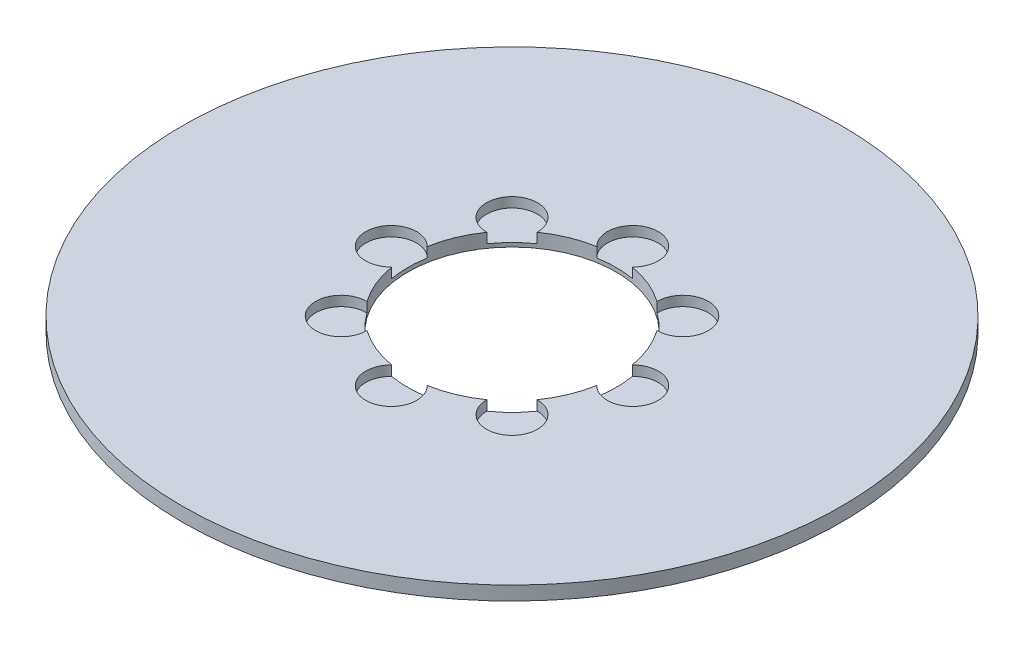
ISO-10303-21;
HEADER;
FILE_DESCRIPTION(('STEP AP214'),'2;1');
FILE_NAME('part.step','',(''),(''),'','','');
FILE_SCHEMA(('AUTOMOTIVE_DESIGN { 1 0 10303 214 1 1 1 1 }'));
ENDSEC;
DATA;
#1=APPLICATION_CONTEXT('core data for automotive mechanical design processes');
#2=APPLICATION_PROTOCOL_DEFINITION('international standard','automotive_design',2000,#1);
#3=PRODUCT_CONTEXT('',#1,'mechanical');
#4=PRODUCT('Part','Part','',(#3));
#5=PRODUCT_RELATED_PRODUCT_CATEGORY('part','',(#4));
#6=PRODUCT_DEFINITION_FORMATION('','',#4);
#7=PRODUCT_DEFINITION_CONTEXT('part definition',#1,'design');
#8=PRODUCT_DEFINITION('design','',#6,#7);
#9=PRODUCT_DEFINITION_SHAPE('','',#8);
#10=(LENGTH_UNIT() NAMED_UNIT(*) SI_UNIT(.MILLI.,.METRE.));
#11=(NAMED_UNIT(*) PLANE_ANGLE_UNIT() SI_UNIT($,.RADIAN.));
#12=(NAMED_UNIT(*) SI_UNIT($,.STERADIAN.) SOLID_ANGLE_UNIT());
#13=UNCERTAINTY_MEASURE_WITH_UNIT(LENGTH_MEASURE(1.E-05),#10,'distance_accuracy_value','');
#14=(GEOMETRIC_REPRESENTATION_CONTEXT(3) GLOBAL_UNCERTAINTY_ASSIGNED_CONTEXT((#13)) GLOBAL_UNIT_ASSIGNED_CONTEXT((#10,
#11,#12)) REPRESENTATION_CONTEXT('',''));
#15=CARTESIAN_POINT('',(0.,0.,0.));
#16=DIRECTION('',(0.,0.,1.));
#17=DIRECTION('',(1.,0.,0.));
#18=AXIS2_PLACEMENT_3D('',#15,#16,#17);
#19=CARTESIAN_POINT('',(0.,4.,0.));
#20=DIRECTION('',(0.,-1.,0.));
#21=DIRECTION('',(0.,0.,-1.));
#22=AXIS2_PLACEMENT_3D('',#19,#20,#21);
#23=CYLINDRICAL_SURFACE('',#22,95.);
#24=CARTESIAN_POINT('',(0.,4.,0.));
#25=DIRECTION('',(0.,1.,0.));
#26=DIRECTION('',(0.,0.,1.));
#27=AXIS2_PLACEMENT_3D('',#24,#25,#26);
#28=CIRCLE('',#27,95.);
#29=CARTESIAN_POINT('',(0.,4.,95.));
#30=VERTEX_POINT('',#29);
#31=EDGE_CURVE('E195',#30,#30,#28,.T.);
#32=ORIENTED_EDGE('',*,*,#31,.F.);
#33=EDGE_LOOP('',(#32));
#34=FACE_BOUND('',#33,.T.);
#35=CARTESIAN_POINT('',(0.,0.,0.));
#36=DIRECTION('',(0.,1.,0.));
#37=DIRECTION('',(0.,0.,1.));
#38=AXIS2_PLACEMENT_3D('',#35,#36,#37);
#39=CIRCLE('',#38,95.);
#40=CARTESIAN_POINT('',(0.,0.,95.));
#41=VERTEX_POINT('',#40);
#42=EDGE_CURVE('E179',#41,#41,#39,.T.);
#43=ORIENTED_EDGE('',*,*,#42,.T.);
#44=EDGE_LOOP('',(#43));
#45=FACE_BOUND('',#44,.T.);
#46=ADVANCED_FACE('F39',(#34,#45),#23,.T.);
#47=CARTESIAN_POINT('',(0.,4.,0.));
#48=DIRECTION('',(0.,1.,0.));
#49=DIRECTION('',(0.,0.,1.));
#50=AXIS2_PLACEMENT_3D('',#47,#48,#49);
#51=PLANE('',#50);
#52=CARTESIAN_POINT('',(1.21564885016385E-13,4.,34.8175668774056));
#53=DIRECTION('',(0.,1.,0.));
#54=DIRECTION('',(1.,0.,0.));
#55=AXIS2_PLACEMENT_3D('',#52,#53,#54);
#56=CIRCLE('',#55,7.33550777129493);
#57=CARTESIAN_POINT('',(-5.11600563197545,4.,29.5605562595428));
#58=VERTEX_POINT('',#57);
#59=CARTESIAN_POINT('',(5.11600563197565,4.,29.5605562595428));
#60=VERTEX_POINT('',#59);
#61=EDGE_CURVE('E176',#58,#60,#56,.T.);
#62=ORIENTED_EDGE('',*,*,#61,.F.);
#63=CARTESIAN_POINT('',(0.,4.,0.));
#64=DIRECTION('',(0.,1.,0.));
#65=DIRECTION('',(0.,0.,1.));
#66=AXIS2_PLACEMENT_3D('',#63,#64,#65);
#67=CIRCLE('',#66,30.);
#68=CARTESIAN_POINT('',(-17.2849075118106,4.,24.5200320617277));
#69=VERTEX_POINT('',#68);
#70=EDGE_CURVE('E166',#69,#58,#67,.T.);
#71=ORIENTED_EDGE('',*,*,#70,.F.);
#72=CARTESIAN_POINT('',(-24.6197376434296,4.,24.6197376434297));
#73=DIRECTION('',(0.,1.,0.));
#74=DIRECTION('',(0.707106781186549,0.,0.707106781186546));
#75=AXIS2_PLACEMENT_3D('',#72,#73,#74);
#76=CIRCLE('',#75,7.33550777129493);
#77=CARTESIAN_POINT('',(-24.5200320617276,4.,17.2849075118107));
#78=VERTEX_POINT('',#77);
#79=EDGE_CURVE('E147',#78,#69,#76,.T.);
#80=ORIENTED_EDGE('',*,*,#79,.F.);
#81=CARTESIAN_POINT('',(-29.5605562595428,4.,5.11600563197555));
#82=VERTEX_POINT('',#81);
#83=EDGE_CURVE('E180',#82,#78,#67,.T.);
#84=ORIENTED_EDGE('',*,*,#83,.F.);
#85=CARTESIAN_POINT('',(-34.8175668774056,4.,0.));
#86=DIRECTION('',(0.,1.,0.));
#87=DIRECTION('',(0.,0.,1.));
#88=AXIS2_PLACEMENT_3D('',#85,#86,#87);
#89=CIRCLE('',#88,7.33550777129493);
#90=CARTESIAN_POINT('',(-29.5605562595428,4.,-5.11600563197555));
#91=VERTEX_POINT('',#90);
#92=EDGE_CURVE('E186',#91,#82,#89,.T.);
#93=ORIENTED_EDGE('',*,*,#92,.F.);
#94=CARTESIAN_POINT('',(-24.5200320617278,4.,-17.2849075118104));
#95=VERTEX_POINT('',#94);
#96=EDGE_CURVE('E182',#95,#91,#67,.T.);
#97=ORIENTED_EDGE('',*,*,#96,.F.);
#98=CARTESIAN_POINT('',(-24.61973764343,4.,-24.6197376434294));
#99=DIRECTION('',(0.,1.,0.));
#100=DIRECTION('',(-0.707106781186539,0.,0.707106781186556));
#101=AXIS2_PLACEMENT_3D('',#98,#99,#100);
#102=CIRCLE('',#101,7.33550777129493);
#103=CARTESIAN_POINT('',(-17.284907511811,4.,-24.5200320617274));
#104=VERTEX_POINT('',#103);
#105=EDGE_CURVE('E446',#104,#95,#102,.T.);
#106=ORIENTED_EDGE('',*,*,#105,.F.);
#107=CARTESIAN_POINT('',(-5.11600563197586,4.,-29.5605562595427));
#108=VERTEX_POINT('',#107);
#109=EDGE_CURVE('E452',#108,#104,#67,.T.);
#110=ORIENTED_EDGE('',*,*,#109,.F.);
#111=CARTESIAN_POINT('',(-3.64694655049154E-13,4.,-34.8175668774056));
#112=DIRECTION('',(0.,1.,0.));
#113=DIRECTION('',(-1.,0.,0.));
#114=AXIS2_PLACEMENT_3D('',#111,#112,#113);
#115=CIRCLE('',#114,7.33550777129493);
#116=CARTESIAN_POINT('',(5.11600563197524,4.,-29.5605562595428));
#117=VERTEX_POINT('',#116);
#118=EDGE_CURVE('E477',#117,#108,#115,.T.);
#119=ORIENTED_EDGE('',*,*,#118,.F.);
#120=CARTESIAN_POINT('',(17.2849075118105,4.,-24.5200320617278));
#121=VERTEX_POINT('',#120);
#122=EDGE_CURVE('E460',#121,#117,#67,.T.);
#123=ORIENTED_EDGE('',*,*,#122,.F.);
#124=CARTESIAN_POINT('',(24.6197376434294,4.,-24.6197376434299));
#125=DIRECTION('',(0.,1.,0.));
#126=DIRECTION('',(-0.707106781186554,0.,-0.707106781186541));
#127=AXIS2_PLACEMENT_3D('',#124,#125,#126);
#128=CIRCLE('',#127,7.33550777129493);
#129=CARTESIAN_POINT('',(24.5200320617275,4.,-17.2849075118109));
#130=VERTEX_POINT('',#129);
#131=EDGE_CURVE('E464',#130,#121,#128,.T.);
#132=ORIENTED_EDGE('',*,*,#131,.F.);
#133=CARTESIAN_POINT('',(29.5605562595428,4.,-5.11600563197555));
#134=VERTEX_POINT('',#133);
#135=EDGE_CURVE('E459',#134,#130,#67,.T.);
#136=ORIENTED_EDGE('',*,*,#135,.F.);
#137=CARTESIAN_POINT('',(34.8175668774056,4.,0.));
#138=DIRECTION('',(0.,1.,0.));
#139=DIRECTION('',(0.,0.,-1.));
#140=AXIS2_PLACEMENT_3D('',#137,#138,#139);
#141=CIRCLE('',#140,7.33550777129493);
#142=CARTESIAN_POINT('',(29.5605562595428,4.,5.11600563197555));
#143=VERTEX_POINT('',#142);
#144=EDGE_CURVE('E469',#143,#134,#141,.T.);
#145=ORIENTED_EDGE('',*,*,#144,.F.);
#146=CARTESIAN_POINT('',(24.5200320617277,4.,17.2849075118105));
#147=VERTEX_POINT('',#146);
#148=EDGE_CURVE('E181',#147,#143,#67,.T.);
#149=ORIENTED_EDGE('',*,*,#148,.F.);
#150=CARTESIAN_POINT('',(24.6197376434298,4.,24.6197376434295));
#151=DIRECTION('',(0.,1.,0.));
#152=DIRECTION('',(0.707106781186544,0.,-0.707106781186551));
#153=AXIS2_PLACEMENT_3D('',#150,#151,#152);
#154=CIRCLE('',#153,7.33550777129493);
#155=CARTESIAN_POINT('',(17.2849075118108,4.,24.5200320617275));
#156=VERTEX_POINT('',#155);
#157=EDGE_CURVE('E475',#156,#147,#154,.T.);
#158=ORIENTED_EDGE('',*,*,#157,.F.);
#159=EDGE_CURVE('E177',#60,#156,#67,.T.);
#160=ORIENTED_EDGE('',*,*,#159,.F.);
#161=EDGE_LOOP('',(#62,#71,#80,#84,#93,#97,#106,#110,#119,#123,#132,#136,#145,#149,#158,#160));
#162=FACE_BOUND('',#161,.T.);
#163=ORIENTED_EDGE('',*,*,#31,.T.);
#164=EDGE_LOOP('',(#163));
#165=FACE_BOUND('',#164,.T.);
#166=ADVANCED_FACE('F172',(#162,#165),#51,.T.);
#167=CARTESIAN_POINT('',(0.,0.,0.));
#168=DIRECTION('',(0.,1.,0.));
#169=DIRECTION('',(0.,0.,1.));
#170=AXIS2_PLACEMENT_3D('',#167,#168,#169);
#171=PLANE('',#170);
#172=CARTESIAN_POINT('',(0.,0.,0.));
#173=DIRECTION('',(0.,1.,0.));
#174=DIRECTION('',(0.,0.,1.));
#175=AXIS2_PLACEMENT_3D('',#172,#173,#174);
#176=CIRCLE('',#175,30.);
#177=CARTESIAN_POINT('',(0.,0.,30.));
#178=VERTEX_POINT('',#177);
#179=EDGE_CURVE('E187',#178,#178,#176,.T.);
#180=ORIENTED_EDGE('',*,*,#179,.T.);
#181=EDGE_LOOP('',(#180));
#182=FACE_BOUND('',#181,.T.);
#183=ORIENTED_EDGE('',*,*,#42,.F.);
#184=EDGE_LOOP('',(#183));
#185=FACE_BOUND('',#184,.T.);
#186=ADVANCED_FACE('F270',(#182,#185),#171,.F.);
#187=CARTESIAN_POINT('',(0.,4.,0.));
#188=DIRECTION('',(0.,-1.,0.));
#189=DIRECTION('',(0.,0.,-1.));
#190=AXIS2_PLACEMENT_3D('',#187,#188,#189);
#191=CYLINDRICAL_SURFACE('',#190,30.);
#192=DIRECTION('',(0.,1.,0.));
#193=VECTOR('',#192,1.);
#194=CARTESIAN_POINT('',(-5.11600563197544,2.56951452846991,29.5605562595428));
#195=LINE('',#194,#193);
#196=CARTESIAN_POINT('',(-5.11600563197545,1.13902905693982,29.5605562595428));
#197=VERTEX_POINT('',#196);
#198=EDGE_CURVE('E11',#197,#58,#195,.T.);
#199=ORIENTED_EDGE('',*,*,#198,.F.);
#200=CARTESIAN_POINT('',(0.,1.13902905693982,0.));
#201=DIRECTION('',(0.,1.,0.));
#202=DIRECTION('',(0.,0.,1.));
#203=AXIS2_PLACEMENT_3D('',#200,#201,#202);
#204=CIRCLE('',#203,30.);
#205=CARTESIAN_POINT('',(5.11600563197565,1.13902905693982,29.5605562595428));
#206=VERTEX_POINT('',#205);
#207=EDGE_CURVE('E250',#197,#206,#204,.T.);
#208=ORIENTED_EDGE('',*,*,#207,.T.);
#209=DIRECTION('',(0.,1.,0.));
#210=VECTOR('',#209,1.);
#211=CARTESIAN_POINT('',(5.11600563197565,2.56951452846991,29.5605562595428));
#212=LINE('',#211,#210);
#213=EDGE_CURVE('E46',#60,#206,#212,.F.);
#214=ORIENTED_EDGE('',*,*,#213,.F.);
#215=ORIENTED_EDGE('',*,*,#159,.T.);
#216=DIRECTION('',(0.,1.,0.));
#217=VECTOR('',#216,1.);
#218=CARTESIAN_POINT('',(17.2849075118108,2.56951452846991,24.5200320617275));
#219=LINE('',#218,#217);
#220=CARTESIAN_POINT('',(17.2849075118108,1.13902905693982,24.5200320617275));
#221=VERTEX_POINT('',#220);
#222=EDGE_CURVE('E244',#221,#156,#219,.T.);
#223=ORIENTED_EDGE('',*,*,#222,.F.);
#224=CARTESIAN_POINT('',(0.,1.13902905693982,0.));
#225=DIRECTION('',(0.,1.,0.));
#226=DIRECTION('',(0.,0.,1.));
#227=AXIS2_PLACEMENT_3D('',#224,#225,#226);
#228=CIRCLE('',#227,30.);
#229=CARTESIAN_POINT('',(24.5200320617277,1.13902905693982,17.2849075118105));
#230=VERTEX_POINT('',#229);
#231=EDGE_CURVE('E238',#221,#230,#228,.T.);
#232=ORIENTED_EDGE('',*,*,#231,.T.);
#233=DIRECTION('',(0.,1.,0.));
#234=VECTOR('',#233,1.);
#235=CARTESIAN_POINT('',(24.5200320617277,2.56951452846991,17.2849075118105));
#236=LINE('',#235,#234);
#237=EDGE_CURVE('E242',#147,#230,#236,.F.);
#238=ORIENTED_EDGE('',*,*,#237,.F.);
#239=ORIENTED_EDGE('',*,*,#148,.T.);
#240=DIRECTION('',(0.,1.,0.));
#241=VECTOR('',#240,1.);
#242=CARTESIAN_POINT('',(29.5605562595428,2.56951452846991,5.11600563197554));
#243=LINE('',#242,#241);
#244=CARTESIAN_POINT('',(29.5605562595428,1.13902905693982,5.11600563197555));
#245=VERTEX_POINT('',#244);
#246=EDGE_CURVE('E236',#245,#143,#243,.T.);
#247=ORIENTED_EDGE('',*,*,#246,.F.);
#248=CARTESIAN_POINT('',(0.,1.13902905693982,0.));
#249=DIRECTION('',(0.,1.,0.));
#250=DIRECTION('',(0.,0.,1.));
#251=AXIS2_PLACEMENT_3D('',#248,#249,#250);
#252=CIRCLE('',#251,30.);
#253=CARTESIAN_POINT('',(29.5605562595428,1.13902905693982,-5.11600563197555));
#254=VERTEX_POINT('',#253);
#255=EDGE_CURVE('E235',#245,#254,#252,.T.);
#256=ORIENTED_EDGE('',*,*,#255,.T.);
#257=DIRECTION('',(0.,1.,0.));
#258=VECTOR('',#257,1.);
#259=CARTESIAN_POINT('',(29.5605562595428,2.56951452846991,-5.11600563197554));
#260=LINE('',#259,#258);
#261=EDGE_CURVE('E234',#134,#254,#260,.F.);
#262=ORIENTED_EDGE('',*,*,#261,.F.);
#263=ORIENTED_EDGE('',*,*,#135,.T.);
#264=DIRECTION('',(0.,1.,0.));
#265=VECTOR('',#264,1.);
#266=CARTESIAN_POINT('',(24.5200320617275,2.56951452846991,-17.2849075118109));
#267=LINE('',#266,#265);
#268=CARTESIAN_POINT('',(24.5200320617275,1.13902905693982,-17.2849075118109));
#269=VERTEX_POINT('',#268);
#270=EDGE_CURVE('E229',#269,#130,#267,.T.);
#271=ORIENTED_EDGE('',*,*,#270,.F.);
#272=CARTESIAN_POINT('',(0.,1.13902905693982,0.));
#273=DIRECTION('',(0.,1.,0.));
#274=DIRECTION('',(0.,0.,1.));
#275=AXIS2_PLACEMENT_3D('',#272,#273,#274);
#276=CIRCLE('',#275,30.);
#277=CARTESIAN_POINT('',(17.2849075118105,1.13902905693982,-24.5200320617278));
#278=VERTEX_POINT('',#277);
#279=EDGE_CURVE('E221',#269,#278,#276,.T.);
#280=ORIENTED_EDGE('',*,*,#279,.T.);
#281=DIRECTION('',(0.,1.,0.));
#282=VECTOR('',#281,1.);
#283=CARTESIAN_POINT('',(17.2849075118105,2.56951452846991,-24.5200320617278));
#284=LINE('',#283,#282);
#285=EDGE_CURVE('E230',#121,#278,#284,.F.);
#286=ORIENTED_EDGE('',*,*,#285,.F.);
#287=ORIENTED_EDGE('',*,*,#122,.T.);
#288=DIRECTION('',(0.,1.,0.));
#289=VECTOR('',#288,1.);
#290=CARTESIAN_POINT('',(5.11600563197523,2.56951452846991,-29.5605562595428));
#291=LINE('',#290,#289);
#292=CARTESIAN_POINT('',(5.11600563197524,1.13902905693982,-29.5605562595428));
#293=VERTEX_POINT('',#292);
#294=EDGE_CURVE('E225',#293,#117,#291,.T.);
#295=ORIENTED_EDGE('',*,*,#294,.F.);
#296=CARTESIAN_POINT('',(0.,1.13902905693982,0.));
#297=DIRECTION('',(0.,1.,0.));
#298=DIRECTION('',(0.,0.,1.));
#299=AXIS2_PLACEMENT_3D('',#296,#297,#298);
#300=CIRCLE('',#299,30.);
#301=CARTESIAN_POINT('',(-5.11600563197586,1.13902905693982,-29.5605562595427));
#302=VERTEX_POINT('',#301);
#303=EDGE_CURVE('E216',#293,#302,#300,.T.);
#304=ORIENTED_EDGE('',*,*,#303,.T.);
#305=DIRECTION('',(0.,1.,0.));
#306=VECTOR('',#305,1.);
#307=CARTESIAN_POINT('',(-5.11600563197586,2.56951452846991,-29.5605562595427));
#308=LINE('',#307,#306);
#309=EDGE_CURVE('E218',#108,#302,#308,.F.);
#310=ORIENTED_EDGE('',*,*,#309,.F.);
#311=ORIENTED_EDGE('',*,*,#109,.T.);
#312=DIRECTION('',(0.,1.,0.));
#313=VECTOR('',#312,1.);
#314=CARTESIAN_POINT('',(-17.284907511811,2.56951452846991,-24.5200320617274));
#315=LINE('',#314,#313);
#316=CARTESIAN_POINT('',(-17.284907511811,1.13902905693982,-24.5200320617274));
#317=VERTEX_POINT('',#316);
#318=EDGE_CURVE('E212',#317,#104,#315,.T.);
#319=ORIENTED_EDGE('',*,*,#318,.F.);
#320=CARTESIAN_POINT('',(0.,1.13902905693982,0.));
#321=DIRECTION('',(0.,1.,0.));
#322=DIRECTION('',(0.,0.,1.));
#323=AXIS2_PLACEMENT_3D('',#320,#321,#322);
#324=CIRCLE('',#323,30.);
#325=CARTESIAN_POINT('',(-24.5200320617278,1.13902905693982,-17.2849075118104));
#326=VERTEX_POINT('',#325);
#327=EDGE_CURVE('E208',#317,#326,#324,.T.);
#328=ORIENTED_EDGE('',*,*,#327,.T.);
#329=DIRECTION('',(0.,1.,0.));
#330=VECTOR('',#329,1.);
#331=CARTESIAN_POINT('',(-24.5200320617278,2.56951452846991,-17.2849075118104));
#332=LINE('',#331,#330);
#333=EDGE_CURVE('E211',#95,#326,#332,.F.);
#334=ORIENTED_EDGE('',*,*,#333,.F.);
#335=ORIENTED_EDGE('',*,*,#96,.T.);
#336=DIRECTION('',(0.,1.,0.));
#337=VECTOR('',#336,1.);
#338=CARTESIAN_POINT('',(-29.5605562595428,2.56951452846991,-5.11600563197554));
#339=LINE('',#338,#337);
#340=CARTESIAN_POINT('',(-29.5605562595428,1.13902905693982,-5.11600563197555));
#341=VERTEX_POINT('',#340);
#342=EDGE_CURVE('E201',#341,#91,#339,.T.);
#343=ORIENTED_EDGE('',*,*,#342,.F.);
#344=CARTESIAN_POINT('',(0.,1.13902905693982,0.));
#345=DIRECTION('',(0.,1.,0.));
#346=DIRECTION('',(0.,0.,1.));
#347=AXIS2_PLACEMENT_3D('',#344,#345,#346);
#348=CIRCLE('',#347,30.);
#349=CARTESIAN_POINT('',(-29.5605562595428,1.13902905693982,5.11600563197555));
#350=VERTEX_POINT('',#349);
#351=EDGE_CURVE('E194',#341,#350,#348,.T.);
#352=ORIENTED_EDGE('',*,*,#351,.T.);
#353=DIRECTION('',(0.,1.,0.));
#354=VECTOR('',#353,1.);
#355=CARTESIAN_POINT('',(-29.5605562595428,2.56951452846991,5.11600563197554));
#356=LINE('',#355,#354);
#357=EDGE_CURVE('E199',#82,#350,#356,.F.);
#358=ORIENTED_EDGE('',*,*,#357,.F.);
#359=ORIENTED_EDGE('',*,*,#83,.T.);
#360=DIRECTION('',(0.,1.,0.));
#361=VECTOR('',#360,1.);
#362=CARTESIAN_POINT('',(-24.5200320617276,2.56951452846991,17.2849075118107));
#363=LINE('',#362,#361);
#364=CARTESIAN_POINT('',(-24.5200320617276,1.13902905693982,17.2849075118107));
#365=VERTEX_POINT('',#364);
#366=EDGE_CURVE('E160',#365,#78,#363,.T.);
#367=ORIENTED_EDGE('',*,*,#366,.F.);
#368=CARTESIAN_POINT('',(0.,1.13902905693982,0.));
#369=DIRECTION('',(0.,1.,0.));
#370=DIRECTION('',(0.,0.,1.));
#371=AXIS2_PLACEMENT_3D('',#368,#369,#370);
#372=CIRCLE('',#371,30.);
#373=CARTESIAN_POINT('',(-17.2849075118106,1.13902905693982,24.5200320617277));
#374=VERTEX_POINT('',#373);
#375=EDGE_CURVE('E168',#365,#374,#372,.T.);
#376=ORIENTED_EDGE('',*,*,#375,.T.);
#377=DIRECTION('',(0.,1.,0.));
#378=VECTOR('',#377,1.);
#379=CARTESIAN_POINT('',(-17.2849075118106,2.56951452846991,24.5200320617277));
#380=LINE('',#379,#378);
#381=EDGE_CURVE('E152',#69,#374,#380,.F.);
#382=ORIENTED_EDGE('',*,*,#381,.F.);
#383=ORIENTED_EDGE('',*,*,#70,.T.);
#384=EDGE_LOOP('',(#199,#208,#214,#215,#223,#232,#238,#239,#247,#256,#262,#263,#271,#280,#286,
#287,#295,#304,#310,#311,#319,#328,#334,#335,#343,#352,#358,#359,#367,#376,#382,#383));
#385=FACE_BOUND('',#384,.T.);
#386=ORIENTED_EDGE('',*,*,#179,.F.);
#387=EDGE_LOOP('',(#386));
#388=FACE_BOUND('',#387,.T.);
#389=ADVANCED_FACE('F170',(#385,#388),#191,.F.);
#390=CARTESIAN_POINT('',(-34.8175668774056,1.13902905693982,0.));
#391=DIRECTION('',(0.,1.,0.));
#392=DIRECTION('',(0.,0.,1.));
#393=AXIS2_PLACEMENT_3D('',#390,#391,#392);
#394=CYLINDRICAL_SURFACE('',#393,7.33550777129493);
#395=ORIENTED_EDGE('',*,*,#342,.T.);
#396=ORIENTED_EDGE('',*,*,#92,.T.);
#397=ORIENTED_EDGE('',*,*,#357,.T.);
#398=CARTESIAN_POINT('',(-34.8175668774056,1.13902905693982,0.));
#399=DIRECTION('',(0.,1.,0.));
#400=DIRECTION('',(0.,0.,1.));
#401=AXIS2_PLACEMENT_3D('',#398,#399,#400);
#402=CIRCLE('',#401,7.33550777129493);
#403=EDGE_CURVE('E191',#341,#350,#402,.T.);
#404=ORIENTED_EDGE('',*,*,#403,.F.);
#405=EDGE_LOOP('',(#395,#396,#397,#404));
#406=FACE_BOUND('',#405,.T.);
#407=ADVANCED_FACE('F279',(#406),#394,.F.);
#408=CARTESIAN_POINT('',(-34.8175668774056,1.13902905693982,0.));
#409=DIRECTION('',(0.,1.,0.));
#410=DIRECTION('',(0.,0.,1.));
#411=AXIS2_PLACEMENT_3D('',#408,#409,#410);
#412=PLANE('',#411);
#413=ORIENTED_EDGE('',*,*,#403,.T.);
#414=ORIENTED_EDGE('',*,*,#351,.F.);
#415=EDGE_LOOP('',(#413,#414));
#416=FACE_BOUND('',#415,.T.);
#417=ADVANCED_FACE('F285',(#416),#412,.T.);
#418=CARTESIAN_POINT('',(-24.6197376434296,1.13902905693982,24.6197376434297));
#419=DIRECTION('',(0.,1.,0.));
#420=DIRECTION('',(0.,0.,1.));
#421=AXIS2_PLACEMENT_3D('',#418,#419,#420);
#422=CYLINDRICAL_SURFACE('',#421,7.33550777129493);
#423=ORIENTED_EDGE('',*,*,#366,.T.);
#424=ORIENTED_EDGE('',*,*,#79,.T.);
#425=ORIENTED_EDGE('',*,*,#381,.T.);
#426=CARTESIAN_POINT('',(-24.6197376434296,1.13902905693982,24.6197376434297));
#427=DIRECTION('',(0.,1.,0.));
#428=DIRECTION('',(0.707106781186549,0.,0.707106781186546));
#429=AXIS2_PLACEMENT_3D('',#426,#427,#428);
#430=CIRCLE('',#429,7.33550777129493);
#431=EDGE_CURVE('E165',#365,#374,#430,.T.);
#432=ORIENTED_EDGE('',*,*,#431,.F.);
#433=EDGE_LOOP('',(#423,#424,#425,#432));
#434=FACE_BOUND('',#433,.T.);
#435=ADVANCED_FACE('F155',(#434),#422,.F.);
#436=CARTESIAN_POINT('',(-24.6197376434296,1.13902905693982,24.6197376434297));
#437=DIRECTION('',(0.,1.,0.));
#438=DIRECTION('',(0.707106781186549,0.,0.707106781186546));
#439=AXIS2_PLACEMENT_3D('',#436,#437,#438);
#440=PLANE('',#439);
#441=ORIENTED_EDGE('',*,*,#431,.T.);
#442=ORIENTED_EDGE('',*,*,#375,.F.);
#443=EDGE_LOOP('',(#441,#442));
#444=FACE_BOUND('',#443,.T.);
#445=ADVANCED_FACE('F288',(#444),#440,.T.);
#446=CARTESIAN_POINT('',(-24.61973764343,1.13902905693982,-24.6197376434294));
#447=DIRECTION('',(0.,1.,0.));
#448=DIRECTION('',(0.,0.,1.));
#449=AXIS2_PLACEMENT_3D('',#446,#447,#448);
#450=CYLINDRICAL_SURFACE('',#449,7.33550777129493);
#451=ORIENTED_EDGE('',*,*,#318,.T.);
#452=ORIENTED_EDGE('',*,*,#105,.T.);
#453=ORIENTED_EDGE('',*,*,#333,.T.);
#454=CARTESIAN_POINT('',(-24.61973764343,1.13902905693982,-24.6197376434294));
#455=DIRECTION('',(0.,1.,0.));
#456=DIRECTION('',(-0.707106781186539,0.,0.707106781186556));
#457=AXIS2_PLACEMENT_3D('',#454,#455,#456);
#458=CIRCLE('',#457,7.33550777129493);
#459=EDGE_CURVE('E447',#317,#326,#458,.T.);
#460=ORIENTED_EDGE('',*,*,#459,.F.);
#461=EDGE_LOOP('',(#451,#452,#453,#460));
#462=FACE_BOUND('',#461,.T.);
#463=ADVANCED_FACE('F295',(#462),#450,.F.);
#464=CARTESIAN_POINT('',(-24.61973764343,1.13902905693982,-24.6197376434294));
#465=DIRECTION('',(0.,1.,0.));
#466=DIRECTION('',(-0.707106781186539,0.,0.707106781186556));
#467=AXIS2_PLACEMENT_3D('',#464,#465,#466);
#468=PLANE('',#467);
#469=ORIENTED_EDGE('',*,*,#459,.T.);
#470=ORIENTED_EDGE('',*,*,#327,.F.);
#471=EDGE_LOOP('',(#469,#470));
#472=FACE_BOUND('',#471,.T.);
#473=ADVANCED_FACE('F375',(#472),#468,.T.);
#474=CARTESIAN_POINT('',(-3.64694655049154E-13,1.13902905693982,-34.8175668774056));
#475=DIRECTION('',(0.,1.,0.));
#476=DIRECTION('',(0.,0.,1.));
#477=AXIS2_PLACEMENT_3D('',#474,#475,#476);
#478=CYLINDRICAL_SURFACE('',#477,7.33550777129493);
#479=ORIENTED_EDGE('',*,*,#294,.T.);
#480=ORIENTED_EDGE('',*,*,#118,.T.);
#481=ORIENTED_EDGE('',*,*,#309,.T.);
#482=CARTESIAN_POINT('',(-3.64694655049154E-13,1.13902905693982,-34.8175668774056));
#483=DIRECTION('',(0.,1.,0.));
#484=DIRECTION('',(-1.,0.,0.));
#485=AXIS2_PLACEMENT_3D('',#482,#483,#484);
#486=CIRCLE('',#485,7.33550777129493);
#487=EDGE_CURVE('E467',#293,#302,#486,.T.);
#488=ORIENTED_EDGE('',*,*,#487,.F.);
#489=EDGE_LOOP('',(#479,#480,#481,#488));
#490=FACE_BOUND('',#489,.T.);
#491=ADVANCED_FACE('F361',(#490),#478,.F.);
#492=CARTESIAN_POINT('',(-3.64694655049154E-13,1.13902905693982,-34.8175668774056));
#493=DIRECTION('',(0.,1.,0.));
#494=DIRECTION('',(-1.,0.,0.));
#495=AXIS2_PLACEMENT_3D('',#492,#493,#494);
#496=PLANE('',#495);
#497=ORIENTED_EDGE('',*,*,#487,.T.);
#498=ORIENTED_EDGE('',*,*,#303,.F.);
#499=EDGE_LOOP('',(#497,#498));
#500=FACE_BOUND('',#499,.T.);
#501=ADVANCED_FACE('F297',(#500),#496,.T.);
#502=CARTESIAN_POINT('',(24.6197376434294,1.13902905693982,-24.6197376434299));
#503=DIRECTION('',(0.,1.,0.));
#504=DIRECTION('',(0.,0.,1.));
#505=AXIS2_PLACEMENT_3D('',#502,#503,#504);
#506=CYLINDRICAL_SURFACE('',#505,7.33550777129493);
#507=ORIENTED_EDGE('',*,*,#270,.T.);
#508=ORIENTED_EDGE('',*,*,#131,.T.);
#509=ORIENTED_EDGE('',*,*,#285,.T.);
#510=CARTESIAN_POINT('',(24.6197376434294,1.13902905693982,-24.6197376434299));
#511=DIRECTION('',(0.,1.,0.));
#512=DIRECTION('',(-0.707106781186554,0.,-0.707106781186541));
#513=AXIS2_PLACEMENT_3D('',#510,#511,#512);
#514=CIRCLE('',#513,7.33550777129493);
#515=EDGE_CURVE('E470',#269,#278,#514,.T.);
#516=ORIENTED_EDGE('',*,*,#515,.F.);
#517=EDGE_LOOP('',(#507,#508,#509,#516));
#518=FACE_BOUND('',#517,.T.);
#519=ADVANCED_FACE('F294',(#518),#506,.F.);
#520=CARTESIAN_POINT('',(24.6197376434294,1.13902905693982,-24.6197376434299));
#521=DIRECTION('',(0.,1.,0.));
#522=DIRECTION('',(-0.707106781186554,0.,-0.707106781186541));
#523=AXIS2_PLACEMENT_3D('',#520,#521,#522);
#524=PLANE('',#523);
#525=ORIENTED_EDGE('',*,*,#515,.T.);
#526=ORIENTED_EDGE('',*,*,#279,.F.);
#527=EDGE_LOOP('',(#525,#526));
#528=FACE_BOUND('',#527,.T.);
#529=ADVANCED_FACE('F300',(#528),#524,.T.);
#530=CARTESIAN_POINT('',(34.8175668774056,1.13902905693982,0.));
#531=DIRECTION('',(0.,1.,0.));
#532=DIRECTION('',(0.,0.,1.));
#533=AXIS2_PLACEMENT_3D('',#530,#531,#532);
#534=CYLINDRICAL_SURFACE('',#533,7.33550777129493);
#535=ORIENTED_EDGE('',*,*,#246,.T.);
#536=ORIENTED_EDGE('',*,*,#144,.T.);
#537=ORIENTED_EDGE('',*,*,#261,.T.);
#538=CARTESIAN_POINT('',(34.8175668774056,1.13902905693982,0.));
#539=DIRECTION('',(0.,1.,0.));
#540=DIRECTION('',(0.,0.,-1.));
#541=AXIS2_PLACEMENT_3D('',#538,#539,#540);
#542=CIRCLE('',#541,7.33550777129493);
#543=EDGE_CURVE('E472',#245,#254,#542,.T.);
#544=ORIENTED_EDGE('',*,*,#543,.F.);
#545=EDGE_LOOP('',(#535,#536,#537,#544));
#546=FACE_BOUND('',#545,.T.);
#547=ADVANCED_FACE('F305',(#546),#534,.F.);
#548=CARTESIAN_POINT('',(34.8175668774056,1.13902905693982,0.));
#549=DIRECTION('',(0.,1.,0.));
#550=DIRECTION('',(0.,0.,-1.));
#551=AXIS2_PLACEMENT_3D('',#548,#549,#550);
#552=PLANE('',#551);
#553=ORIENTED_EDGE('',*,*,#543,.T.);
#554=ORIENTED_EDGE('',*,*,#255,.F.);
#555=EDGE_LOOP('',(#553,#554));
#556=FACE_BOUND('',#555,.T.);
#557=ADVANCED_FACE('F308',(#556),#552,.T.);
#558=CARTESIAN_POINT('',(24.6197376434298,1.13902905693982,24.6197376434295));
#559=DIRECTION('',(0.,1.,0.));
#560=DIRECTION('',(0.,0.,1.));
#561=AXIS2_PLACEMENT_3D('',#558,#559,#560);
#562=CYLINDRICAL_SURFACE('',#561,7.33550777129493);
#563=ORIENTED_EDGE('',*,*,#222,.T.);
#564=ORIENTED_EDGE('',*,*,#157,.T.);
#565=ORIENTED_EDGE('',*,*,#237,.T.);
#566=CARTESIAN_POINT('',(24.6197376434298,1.13902905693982,24.6197376434295));
#567=DIRECTION('',(0.,1.,0.));
#568=DIRECTION('',(0.707106781186544,0.,-0.707106781186551));
#569=AXIS2_PLACEMENT_3D('',#566,#567,#568);
#570=CIRCLE('',#569,7.33550777129493);
#571=EDGE_CURVE('E56',#221,#230,#570,.T.);
#572=ORIENTED_EDGE('',*,*,#571,.F.);
#573=EDGE_LOOP('',(#563,#564,#565,#572));
#574=FACE_BOUND('',#573,.T.);
#575=ADVANCED_FACE('F309',(#574),#562,.F.);
#576=CARTESIAN_POINT('',(24.6197376434298,1.13902905693982,24.6197376434295));
#577=DIRECTION('',(0.,1.,0.));
#578=DIRECTION('',(0.707106781186544,0.,-0.707106781186551));
#579=AXIS2_PLACEMENT_3D('',#576,#577,#578);
#580=PLANE('',#579);
#581=ORIENTED_EDGE('',*,*,#571,.T.);
#582=ORIENTED_EDGE('',*,*,#231,.F.);
#583=EDGE_LOOP('',(#581,#582));
#584=FACE_BOUND('',#583,.T.);
#585=ADVANCED_FACE('F256',(#584),#580,.T.);
#586=CARTESIAN_POINT('',(1.21564885016385E-13,1.13902905693982,34.8175668774056));
#587=DIRECTION('',(0.,1.,0.));
#588=DIRECTION('',(0.,0.,1.));
#589=AXIS2_PLACEMENT_3D('',#586,#587,#588);
#590=CYLINDRICAL_SURFACE('',#589,7.33550777129493);
#591=ORIENTED_EDGE('',*,*,#198,.T.);
#592=ORIENTED_EDGE('',*,*,#61,.T.);
#593=ORIENTED_EDGE('',*,*,#213,.T.);
#594=CARTESIAN_POINT('',(1.21564885016385E-13,1.13902905693982,34.8175668774056));
#595=DIRECTION('',(0.,1.,0.));
#596=DIRECTION('',(1.,0.,0.));
#597=AXIS2_PLACEMENT_3D('',#594,#595,#596);
#598=CIRCLE('',#597,7.33550777129493);
#599=EDGE_CURVE('E55',#197,#206,#598,.T.);
#600=ORIENTED_EDGE('',*,*,#599,.F.);
#601=EDGE_LOOP('',(#591,#592,#593,#600));
#602=FACE_BOUND('',#601,.T.);
#603=ADVANCED_FACE('F253',(#602),#590,.F.);
#604=CARTESIAN_POINT('',(1.21564885016385E-13,1.13902905693982,34.8175668774056));
#605=DIRECTION('',(0.,1.,0.));
#606=DIRECTION('',(1.,0.,0.));
#607=AXIS2_PLACEMENT_3D('',#604,#605,#606);
#608=PLANE('',#607);
#609=ORIENTED_EDGE('',*,*,#599,.T.);
#610=ORIENTED_EDGE('',*,*,#207,.F.);
#611=EDGE_LOOP('',(#609,#610));
#612=FACE_BOUND('',#611,.T.);
#613=ADVANCED_FACE('F252',(#612),#608,.T.);
#614=CLOSED_SHELL('',(#46,#166,#186,#389,#407,#417,#435,#445,#463,#473,#491,#501,#519,#529,#547,
#557,#575,#585,#603,#613));
#615=MANIFOLD_SOLID_BREP('B2',#614);
#616=ADVANCED_BREP_SHAPE_REPRESENTATION('',(#18,#615),#14);
#617=SHAPE_DEFINITION_REPRESENTATION(#9,#616);
ENDSEC;
END-ISO-10303-21;
